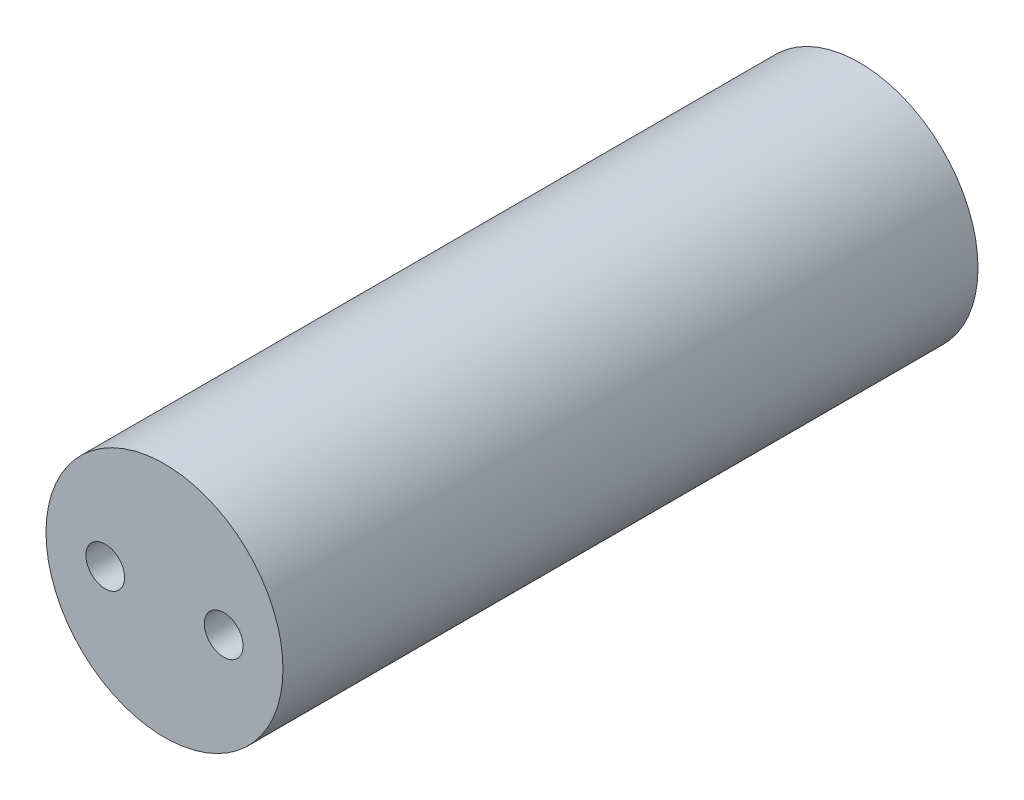
ISO-10303-21;
HEADER;
FILE_DESCRIPTION(('STEP AP214'),'2;1');
FILE_NAME('part.step','',(''),(''),'','','');
FILE_SCHEMA(('AUTOMOTIVE_DESIGN { 1 0 10303 214 1 1 1 1 }'));
ENDSEC;
DATA;
#1=APPLICATION_CONTEXT('core data for automotive mechanical design processes');
#2=APPLICATION_PROTOCOL_DEFINITION('international standard','automotive_design',2000,#1);
#3=PRODUCT_CONTEXT('',#1,'mechanical');
#4=PRODUCT('Part','Part','',(#3));
#5=PRODUCT_RELATED_PRODUCT_CATEGORY('part','',(#4));
#6=PRODUCT_DEFINITION_FORMATION('','',#4);
#7=PRODUCT_DEFINITION_CONTEXT('part definition',#1,'design');
#8=PRODUCT_DEFINITION('design','',#6,#7);
#9=PRODUCT_DEFINITION_SHAPE('','',#8);
#10=(LENGTH_UNIT() NAMED_UNIT(*) SI_UNIT(.MILLI.,.METRE.));
#11=(NAMED_UNIT(*) PLANE_ANGLE_UNIT() SI_UNIT($,.RADIAN.));
#12=(NAMED_UNIT(*) SI_UNIT($,.STERADIAN.) SOLID_ANGLE_UNIT());
#13=UNCERTAINTY_MEASURE_WITH_UNIT(LENGTH_MEASURE(1.E-05),#10,'distance_accuracy_value','');
#14=(GEOMETRIC_REPRESENTATION_CONTEXT(3) GLOBAL_UNCERTAINTY_ASSIGNED_CONTEXT((#13)) GLOBAL_UNIT_ASSIGNED_CONTEXT((#10,
#11,#12)) REPRESENTATION_CONTEXT('',''));
#15=CARTESIAN_POINT('',(0.,0.,0.));
#16=DIRECTION('',(0.,0.,1.));
#17=DIRECTION('',(1.,0.,0.));
#18=AXIS2_PLACEMENT_3D('',#15,#16,#17);
#19=CARTESIAN_POINT('',(0.,0.,88.));
#20=DIRECTION('',(0.,0.,-1.));
#21=DIRECTION('',(-1.,0.,0.));
#22=AXIS2_PLACEMENT_3D('',#19,#20,#21);
#23=CYLINDRICAL_SURFACE('',#22,15.);
#24=CARTESIAN_POINT('',(0.,0.,88.));
#25=DIRECTION('',(0.,0.,1.));
#26=DIRECTION('',(1.,0.,0.));
#27=AXIS2_PLACEMENT_3D('',#24,#25,#26);
#28=CIRCLE('',#27,15.);
#29=CARTESIAN_POINT('',(15.,0.,88.));
#30=VERTEX_POINT('',#29);
#31=EDGE_CURVE('E10',#30,#30,#28,.T.);
#32=ORIENTED_EDGE('',*,*,#31,.F.);
#33=EDGE_LOOP('',(#32));
#34=FACE_BOUND('',#33,.T.);
#35=CARTESIAN_POINT('',(0.,0.,0.));
#36=DIRECTION('',(0.,0.,1.));
#37=DIRECTION('',(1.,0.,0.));
#38=AXIS2_PLACEMENT_3D('',#35,#36,#37);
#39=CIRCLE('',#38,15.);
#40=CARTESIAN_POINT('',(15.,0.,0.));
#41=VERTEX_POINT('',#40);
#42=EDGE_CURVE('E35',#41,#41,#39,.T.);
#43=ORIENTED_EDGE('',*,*,#42,.T.);
#44=EDGE_LOOP('',(#43));
#45=FACE_BOUND('',#44,.T.);
#46=ADVANCED_FACE('F28',(#34,#45),#23,.T.);
#47=CARTESIAN_POINT('',(0.,0.,88.));
#48=DIRECTION('',(0.,0.,1.));
#49=DIRECTION('',(1.,0.,0.));
#50=AXIS2_PLACEMENT_3D('',#47,#48,#49);
#51=PLANE('',#50);
#52=CARTESIAN_POINT('',(7.5,0.,88.));
#53=DIRECTION('',(0.,0.,1.));
#54=DIRECTION('',(1.,0.,0.));
#55=AXIS2_PLACEMENT_3D('',#52,#53,#54);
#56=CIRCLE('',#55,2.45);
#57=CARTESIAN_POINT('',(9.95,0.,88.));
#58=VERTEX_POINT('',#57);
#59=EDGE_CURVE('E52',#58,#58,#56,.T.);
#60=ORIENTED_EDGE('',*,*,#59,.F.);
#61=EDGE_LOOP('',(#60));
#62=FACE_BOUND('',#61,.T.);
#63=CARTESIAN_POINT('',(-7.5,0.,88.));
#64=DIRECTION('',(0.,0.,1.));
#65=DIRECTION('',(1.,0.,0.));
#66=AXIS2_PLACEMENT_3D('',#63,#64,#65);
#67=CIRCLE('',#66,2.45);
#68=CARTESIAN_POINT('',(-5.05,0.,88.));
#69=VERTEX_POINT('',#68);
#70=EDGE_CURVE('E43',#69,#69,#67,.T.);
#71=ORIENTED_EDGE('',*,*,#70,.F.);
#72=EDGE_LOOP('',(#71));
#73=FACE_BOUND('',#72,.T.);
#74=ORIENTED_EDGE('',*,*,#31,.T.);
#75=EDGE_LOOP('',(#74));
#76=FACE_BOUND('',#75,.T.);
#77=ADVANCED_FACE('F61',(#62,#73,#76),#51,.T.);
#78=CARTESIAN_POINT('',(0.,0.,0.));
#79=DIRECTION('',(0.,0.,1.));
#80=DIRECTION('',(1.,0.,0.));
#81=AXIS2_PLACEMENT_3D('',#78,#79,#80);
#82=PLANE('',#81);
#83=CARTESIAN_POINT('',(7.5,0.,0.));
#84=DIRECTION('',(0.,0.,1.));
#85=DIRECTION('',(1.,0.,0.));
#86=AXIS2_PLACEMENT_3D('',#83,#84,#85);
#87=CIRCLE('',#86,2.45);
#88=CARTESIAN_POINT('',(9.95,0.,0.));
#89=VERTEX_POINT('',#88);
#90=EDGE_CURVE('E31',#89,#89,#87,.T.);
#91=ORIENTED_EDGE('',*,*,#90,.T.);
#92=EDGE_LOOP('',(#91));
#93=FACE_BOUND('',#92,.T.);
#94=CARTESIAN_POINT('',(-7.5,0.,0.));
#95=DIRECTION('',(0.,0.,1.));
#96=DIRECTION('',(1.,0.,0.));
#97=AXIS2_PLACEMENT_3D('',#94,#95,#96);
#98=CIRCLE('',#97,2.45);
#99=CARTESIAN_POINT('',(-5.05,0.,0.));
#100=VERTEX_POINT('',#99);
#101=EDGE_CURVE('E40',#100,#100,#98,.T.);
#102=ORIENTED_EDGE('',*,*,#101,.T.);
#103=EDGE_LOOP('',(#102));
#104=FACE_BOUND('',#103,.T.);
#105=ORIENTED_EDGE('',*,*,#42,.F.);
#106=EDGE_LOOP('',(#105));
#107=FACE_BOUND('',#106,.T.);
#108=ADVANCED_FACE('F64',(#93,#104,#107),#82,.F.);
#109=CARTESIAN_POINT('',(-7.5,0.,-12.));
#110=DIRECTION('',(0.,0.,1.));
#111=DIRECTION('',(1.,0.,0.));
#112=AXIS2_PLACEMENT_3D('',#109,#110,#111);
#113=CYLINDRICAL_SURFACE('',#112,2.45);
#114=CARTESIAN_POINT('',(-5.05,0.,88.));
#115=CARTESIAN_POINT('',(-5.05,0.,87.0833333333333));
#116=CARTESIAN_POINT('',(-5.05,0.,86.1666666666667));
#117=CARTESIAN_POINT('',(-5.05,0.,84.3333333333333));
#118=CARTESIAN_POINT('',(-5.05,0.,83.4166666666667));
#119=CARTESIAN_POINT('',(-5.05,0.,81.5833333333333));
#120=CARTESIAN_POINT('',(-5.05,0.,80.6666666666667));
#121=CARTESIAN_POINT('',(-5.05,0.,78.8333333333333));
#122=CARTESIAN_POINT('',(-5.05,0.,77.9166666666667));
#123=CARTESIAN_POINT('',(-5.05,0.,76.0833333333333));
#124=CARTESIAN_POINT('',(-5.05,0.,75.1666666666667));
#125=CARTESIAN_POINT('',(-5.05,0.,73.3333333333333));
#126=CARTESIAN_POINT('',(-5.05,0.,72.4166666666667));
#127=CARTESIAN_POINT('',(-5.05,0.,70.5833333333333));
#128=CARTESIAN_POINT('',(-5.05,0.,69.6666666666667));
#129=CARTESIAN_POINT('',(-5.05,0.,67.8333333333333));
#130=CARTESIAN_POINT('',(-5.05,0.,66.9166666666667));
#131=CARTESIAN_POINT('',(-5.05,0.,65.0833333333333));
#132=CARTESIAN_POINT('',(-5.05,0.,64.1666666666667));
#133=CARTESIAN_POINT('',(-5.05,0.,62.3333333333333));
#134=CARTESIAN_POINT('',(-5.05,0.,61.4166666666667));
#135=CARTESIAN_POINT('',(-5.05,0.,59.5833333333333));
#136=CARTESIAN_POINT('',(-5.05,0.,58.6666666666667));
#137=CARTESIAN_POINT('',(-5.05,0.,56.8333333333333));
#138=CARTESIAN_POINT('',(-5.05,0.,55.9166666666667));
#139=CARTESIAN_POINT('',(-5.05,0.,54.0833333333333));
#140=CARTESIAN_POINT('',(-5.05,0.,53.1666666666667));
#141=CARTESIAN_POINT('',(-5.05,0.,51.3333333333333));
#142=CARTESIAN_POINT('',(-5.05,0.,50.4166666666667));
#143=CARTESIAN_POINT('',(-5.05,0.,48.5833333333333));
#144=CARTESIAN_POINT('',(-5.05,0.,47.6666666666667));
#145=CARTESIAN_POINT('',(-5.05,0.,45.8333333333333));
#146=CARTESIAN_POINT('',(-5.05,0.,44.9166666666667));
#147=CARTESIAN_POINT('',(-5.05,0.,43.0833333333333));
#148=CARTESIAN_POINT('',(-5.05,0.,42.1666666666667));
#149=CARTESIAN_POINT('',(-5.05,0.,40.3333333333333));
#150=CARTESIAN_POINT('',(-5.05,0.,39.4166666666667));
#151=CARTESIAN_POINT('',(-5.05,0.,37.5833333333333));
#152=CARTESIAN_POINT('',(-5.05,0.,36.6666666666667));
#153=CARTESIAN_POINT('',(-5.05,0.,34.8333333333333));
#154=CARTESIAN_POINT('',(-5.05,0.,33.9166666666667));
#155=CARTESIAN_POINT('',(-5.05,0.,32.0833333333333));
#156=CARTESIAN_POINT('',(-5.05,0.,31.1666666666667));
#157=CARTESIAN_POINT('',(-5.05,0.,29.3333333333333));
#158=CARTESIAN_POINT('',(-5.05,0.,28.4166666666667));
#159=CARTESIAN_POINT('',(-5.05,0.,26.5833333333333));
#160=CARTESIAN_POINT('',(-5.05,0.,25.6666666666667));
#161=CARTESIAN_POINT('',(-5.05,0.,23.8333333333333));
#162=CARTESIAN_POINT('',(-5.05,0.,22.9166666666667));
#163=CARTESIAN_POINT('',(-5.05,0.,21.0833333333333));
#164=CARTESIAN_POINT('',(-5.05,0.,20.1666666666667));
#165=CARTESIAN_POINT('',(-5.05,0.,18.3333333333333));
#166=CARTESIAN_POINT('',(-5.05,0.,17.4166666666667));
#167=CARTESIAN_POINT('',(-5.05,0.,15.5833333333333));
#168=CARTESIAN_POINT('',(-5.05,0.,14.6666666666667));
#169=CARTESIAN_POINT('',(-5.05,0.,12.8333333333333));
#170=CARTESIAN_POINT('',(-5.05,0.,11.9166666666667));
#171=CARTESIAN_POINT('',(-5.05,0.,10.0833333333333));
#172=CARTESIAN_POINT('',(-5.05,0.,9.16666666666667));
#173=CARTESIAN_POINT('',(-5.05,0.,7.33333333333334));
#174=CARTESIAN_POINT('',(-5.05,0.,6.41666666666667));
#175=CARTESIAN_POINT('',(-5.05,0.,4.58333333333333));
#176=CARTESIAN_POINT('',(-5.05,0.,3.66666666666667));
#177=CARTESIAN_POINT('',(-5.05,0.,1.83333333333333));
#178=CARTESIAN_POINT('',(-5.05,0.,0.916666666666665));
#179=CARTESIAN_POINT('',(-5.05,0.,0.));
#180=B_SPLINE_CURVE_WITH_KNOTS('',3,(#114,#115,#116,#117,#118,#119,#120,#121,#122,#123,#124,
#125,#126,#127,#128,#129,#130,#131,#132,#133,#134,#135,#136,#137,#138,#139,#140,#141,#142,#143,
#144,#145,#146,#147,#148,#149,#150,#151,#152,#153,#154,#155,#156,#157,#158,#159,#160,#161,#162,
#163,#164,#165,#166,#167,#168,#169,#170,#171,#172,#173,#174,#175,#176,#177,#178,#179),
.UNSPECIFIED.,.F.,.F.,(4,2,2,2,2,2,2,2,2,2,2,2,2,2,2,2,2,2,2,2,2,2,2,2,2,2,2,2,2,2,2,2,4),(0.,
2.75,5.50000000000001,8.25000000000001,11.,13.75,16.5,19.25,22.,24.75,27.5,30.25,33.,35.75,38.5,
41.25,44.,46.75,49.5,52.25,55.,57.75,60.5,63.25,66.,68.75,71.5,74.25,77.,79.75,82.5,85.25,88.),.UNSPECIFIED.);
#181=EDGE_CURVE('BSEAM70',#69,#100,#180,.T.);
#182=ORIENTED_EDGE('',*,*,#70,.T.);
#183=ORIENTED_EDGE('',*,*,#101,.F.);
#184=ORIENTED_EDGE('',*,*,#181,.T.);
#185=ORIENTED_EDGE('',*,*,#181,.F.);
#186=EDGE_LOOP('',(#182,#184,#183,#185));
#187=FACE_BOUND('',#186,.T.);
#188=ADVANCED_FACE('F70',(#187),#113,.F.);
#189=CARTESIAN_POINT('',(7.5,0.,-12.));
#190=DIRECTION('',(0.,0.,1.));
#191=DIRECTION('',(1.,0.,0.));
#192=AXIS2_PLACEMENT_3D('',#189,#190,#191);
#193=CYLINDRICAL_SURFACE('',#192,2.45);
#194=CARTESIAN_POINT('',(9.95,0.,88.));
#195=CARTESIAN_POINT('',(9.95,0.,87.0833333333333));
#196=CARTESIAN_POINT('',(9.95,0.,86.1666666666667));
#197=CARTESIAN_POINT('',(9.95,0.,84.3333333333333));
#198=CARTESIAN_POINT('',(9.95,0.,83.4166666666667));
#199=CARTESIAN_POINT('',(9.95,0.,81.5833333333333));
#200=CARTESIAN_POINT('',(9.95,0.,80.6666666666667));
#201=CARTESIAN_POINT('',(9.95,0.,78.8333333333333));
#202=CARTESIAN_POINT('',(9.95,0.,77.9166666666667));
#203=CARTESIAN_POINT('',(9.95,0.,76.0833333333333));
#204=CARTESIAN_POINT('',(9.95,0.,75.1666666666667));
#205=CARTESIAN_POINT('',(9.95,0.,73.3333333333333));
#206=CARTESIAN_POINT('',(9.95,0.,72.4166666666667));
#207=CARTESIAN_POINT('',(9.95,0.,70.5833333333333));
#208=CARTESIAN_POINT('',(9.95,0.,69.6666666666667));
#209=CARTESIAN_POINT('',(9.95,0.,67.8333333333333));
#210=CARTESIAN_POINT('',(9.95,0.,66.9166666666667));
#211=CARTESIAN_POINT('',(9.95,0.,65.0833333333333));
#212=CARTESIAN_POINT('',(9.95,0.,64.1666666666667));
#213=CARTESIAN_POINT('',(9.95,0.,62.3333333333333));
#214=CARTESIAN_POINT('',(9.95,0.,61.4166666666667));
#215=CARTESIAN_POINT('',(9.95,0.,59.5833333333333));
#216=CARTESIAN_POINT('',(9.95,0.,58.6666666666667));
#217=CARTESIAN_POINT('',(9.95,0.,56.8333333333333));
#218=CARTESIAN_POINT('',(9.95,0.,55.9166666666667));
#219=CARTESIAN_POINT('',(9.95,0.,54.0833333333333));
#220=CARTESIAN_POINT('',(9.95,0.,53.1666666666667));
#221=CARTESIAN_POINT('',(9.95,0.,51.3333333333333));
#222=CARTESIAN_POINT('',(9.95,0.,50.4166666666667));
#223=CARTESIAN_POINT('',(9.95,0.,48.5833333333333));
#224=CARTESIAN_POINT('',(9.95,0.,47.6666666666667));
#225=CARTESIAN_POINT('',(9.95,0.,45.8333333333333));
#226=CARTESIAN_POINT('',(9.95,0.,44.9166666666667));
#227=CARTESIAN_POINT('',(9.95,0.,43.0833333333333));
#228=CARTESIAN_POINT('',(9.95,0.,42.1666666666667));
#229=CARTESIAN_POINT('',(9.95,0.,40.3333333333333));
#230=CARTESIAN_POINT('',(9.95,0.,39.4166666666667));
#231=CARTESIAN_POINT('',(9.95,0.,37.5833333333333));
#232=CARTESIAN_POINT('',(9.95,0.,36.6666666666667));
#233=CARTESIAN_POINT('',(9.95,0.,34.8333333333333));
#234=CARTESIAN_POINT('',(9.95,0.,33.9166666666667));
#235=CARTESIAN_POINT('',(9.95,0.,32.0833333333333));
#236=CARTESIAN_POINT('',(9.95,0.,31.1666666666667));
#237=CARTESIAN_POINT('',(9.95,0.,29.3333333333333));
#238=CARTESIAN_POINT('',(9.95,0.,28.4166666666667));
#239=CARTESIAN_POINT('',(9.95,0.,26.5833333333333));
#240=CARTESIAN_POINT('',(9.95,0.,25.6666666666667));
#241=CARTESIAN_POINT('',(9.95,0.,23.8333333333333));
#242=CARTESIAN_POINT('',(9.95,0.,22.9166666666667));
#243=CARTESIAN_POINT('',(9.95,0.,21.0833333333333));
#244=CARTESIAN_POINT('',(9.95,0.,20.1666666666667));
#245=CARTESIAN_POINT('',(9.95,0.,18.3333333333333));
#246=CARTESIAN_POINT('',(9.95,0.,17.4166666666667));
#247=CARTESIAN_POINT('',(9.95,0.,15.5833333333333));
#248=CARTESIAN_POINT('',(9.95,0.,14.6666666666667));
#249=CARTESIAN_POINT('',(9.95,0.,12.8333333333333));
#250=CARTESIAN_POINT('',(9.95,0.,11.9166666666667));
#251=CARTESIAN_POINT('',(9.95,0.,10.0833333333333));
#252=CARTESIAN_POINT('',(9.95,0.,9.16666666666667));
#253=CARTESIAN_POINT('',(9.95,0.,7.33333333333334));
#254=CARTESIAN_POINT('',(9.95,0.,6.41666666666667));
#255=CARTESIAN_POINT('',(9.95,0.,4.58333333333333));
#256=CARTESIAN_POINT('',(9.95,0.,3.66666666666667));
#257=CARTESIAN_POINT('',(9.95,0.,1.83333333333333));
#258=CARTESIAN_POINT('',(9.95,0.,0.916666666666665));
#259=CARTESIAN_POINT('',(9.95,0.,0.));
#260=B_SPLINE_CURVE_WITH_KNOTS('',3,(#194,#195,#196,#197,#198,#199,#200,#201,#202,#203,#204,
#205,#206,#207,#208,#209,#210,#211,#212,#213,#214,#215,#216,#217,#218,#219,#220,#221,#222,#223,
#224,#225,#226,#227,#228,#229,#230,#231,#232,#233,#234,#235,#236,#237,#238,#239,#240,#241,#242,
#243,#244,#245,#246,#247,#248,#249,#250,#251,#252,#253,#254,#255,#256,#257,#258,#259),
.UNSPECIFIED.,.F.,.F.,(4,2,2,2,2,2,2,2,2,2,2,2,2,2,2,2,2,2,2,2,2,2,2,2,2,2,2,2,2,2,2,2,4),(0.,
2.75,5.50000000000001,8.25000000000001,11.,13.75,16.5,19.25,22.,24.75,27.5,30.25,33.,35.75,38.5,
41.25,44.,46.75,49.5,52.25,55.,57.75,60.5,63.25,66.,68.75,71.5,74.25,77.,79.75,82.5,85.25,88.),.UNSPECIFIED.);
#261=EDGE_CURVE('BSEAM58',#58,#89,#260,.T.);
#262=ORIENTED_EDGE('',*,*,#59,.T.);
#263=ORIENTED_EDGE('',*,*,#90,.F.);
#264=ORIENTED_EDGE('',*,*,#261,.T.);
#265=ORIENTED_EDGE('',*,*,#261,.F.);
#266=EDGE_LOOP('',(#262,#264,#263,#265));
#267=FACE_BOUND('',#266,.T.);
#268=ADVANCED_FACE('F58',(#267),#193,.F.);
#269=CLOSED_SHELL('',(#46,#77,#108,#188,#268));
#270=MANIFOLD_SOLID_BREP('B2',#269);
#271=ADVANCED_BREP_SHAPE_REPRESENTATION('',(#18,#270),#14);
#272=SHAPE_DEFINITION_REPRESENTATION(#9,#271);
ENDSEC;
END-ISO-10303-21;
